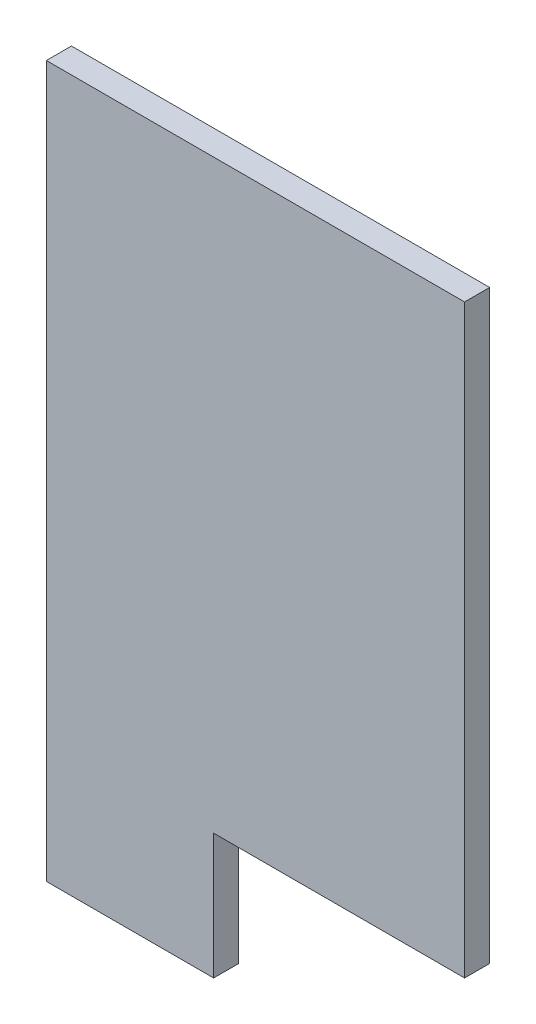
ISO-10303-21;
HEADER;
FILE_DESCRIPTION(('STEP AP214'),'2;1');
FILE_NAME('part.step','',(''),(''),'','','');
FILE_SCHEMA(('AUTOMOTIVE_DESIGN { 1 0 10303 214 1 1 1 1 }'));
ENDSEC;
DATA;
#1=APPLICATION_CONTEXT('core data for automotive mechanical design processes');
#2=APPLICATION_PROTOCOL_DEFINITION('international standard','automotive_design',2000,#1);
#3=PRODUCT_CONTEXT('',#1,'mechanical');
#4=PRODUCT('Part','Part','',(#3));
#5=PRODUCT_RELATED_PRODUCT_CATEGORY('part','',(#4));
#6=PRODUCT_DEFINITION_FORMATION('','',#4);
#7=PRODUCT_DEFINITION_CONTEXT('part definition',#1,'design');
#8=PRODUCT_DEFINITION('design','',#6,#7);
#9=PRODUCT_DEFINITION_SHAPE('','',#8);
#10=(LENGTH_UNIT() NAMED_UNIT(*) SI_UNIT(.MILLI.,.METRE.));
#11=(NAMED_UNIT(*) PLANE_ANGLE_UNIT() SI_UNIT($,.RADIAN.));
#12=(NAMED_UNIT(*) SI_UNIT($,.STERADIAN.) SOLID_ANGLE_UNIT());
#13=UNCERTAINTY_MEASURE_WITH_UNIT(LENGTH_MEASURE(1.E-05),#10,'distance_accuracy_value','');
#14=(GEOMETRIC_REPRESENTATION_CONTEXT(3) GLOBAL_UNCERTAINTY_ASSIGNED_CONTEXT((#13)) GLOBAL_UNIT_ASSIGNED_CONTEXT((#10,
#11,#12)) REPRESENTATION_CONTEXT('',''));
#15=CARTESIAN_POINT('',(0.,0.,0.));
#16=DIRECTION('',(0.,0.,1.));
#17=DIRECTION('',(1.,0.,0.));
#18=AXIS2_PLACEMENT_3D('',#15,#16,#17);
#19=CARTESIAN_POINT('',(25.,35.,3.));
#20=DIRECTION('',(-1.,0.,0.));
#21=DIRECTION('',(0.,0.,1.));
#22=AXIS2_PLACEMENT_3D('',#19,#20,#21);
#23=PLANE('',#22);
#24=DIRECTION('',(0.,1.,0.));
#25=VECTOR('',#24,1.);
#26=CARTESIAN_POINT('',(25.,35.,0.));
#27=LINE('',#26,#25);
#28=CARTESIAN_POINT('',(25.,-35.,0.));
#29=VERTEX_POINT('',#28);
#30=CARTESIAN_POINT('',(25.,35.,0.));
#31=VERTEX_POINT('',#30);
#32=EDGE_CURVE('E128',#29,#31,#27,.T.);
#33=ORIENTED_EDGE('',*,*,#32,.T.);
#34=DIRECTION('',(0.,0.,-1.));
#35=VECTOR('',#34,1.);
#36=CARTESIAN_POINT('',(25.,35.,3.));
#37=LINE('',#36,#35);
#38=CARTESIAN_POINT('',(25.,35.,3.));
#39=VERTEX_POINT('',#38);
#40=EDGE_CURVE('E11',#39,#31,#37,.T.);
#41=ORIENTED_EDGE('',*,*,#40,.F.);
#42=DIRECTION('',(0.,1.,0.));
#43=VECTOR('',#42,1.);
#44=CARTESIAN_POINT('',(25.,35.,3.));
#45=LINE('',#44,#43);
#46=CARTESIAN_POINT('',(25.,-35.,3.));
#47=VERTEX_POINT('',#46);
#48=EDGE_CURVE('E145',#47,#39,#45,.T.);
#49=ORIENTED_EDGE('',*,*,#48,.F.);
#50=DIRECTION('',(0.,0.,-1.));
#51=VECTOR('',#50,1.);
#52=CARTESIAN_POINT('',(25.,-35.,3.));
#53=LINE('',#52,#51);
#54=EDGE_CURVE('E124',#47,#29,#53,.T.);
#55=ORIENTED_EDGE('',*,*,#54,.T.);
#56=EDGE_LOOP('',(#33,#41,#49,#55));
#57=FACE_BOUND('',#56,.T.);
#58=ADVANCED_FACE('F39',(#57),#23,.F.);
#59=CARTESIAN_POINT('',(-25.,35.,3.));
#60=DIRECTION('',(0.,-1.,0.));
#61=DIRECTION('',(0.,0.,-1.));
#62=AXIS2_PLACEMENT_3D('',#59,#60,#61);
#63=PLANE('',#62);
#64=DIRECTION('',(-1.,0.,0.));
#65=VECTOR('',#64,1.);
#66=CARTESIAN_POINT('',(-25.,35.,0.));
#67=LINE('',#66,#65);
#68=CARTESIAN_POINT('',(-25.,35.,0.));
#69=VERTEX_POINT('',#68);
#70=EDGE_CURVE('E132',#31,#69,#67,.T.);
#71=ORIENTED_EDGE('',*,*,#70,.T.);
#72=DIRECTION('',(0.,0.,-1.));
#73=VECTOR('',#72,1.);
#74=CARTESIAN_POINT('',(-25.,35.,3.));
#75=LINE('',#74,#73);
#76=CARTESIAN_POINT('',(-25.,35.,3.));
#77=VERTEX_POINT('',#76);
#78=EDGE_CURVE('E48',#77,#69,#75,.T.);
#79=ORIENTED_EDGE('',*,*,#78,.F.);
#80=DIRECTION('',(-1.,0.,0.));
#81=VECTOR('',#80,1.);
#82=CARTESIAN_POINT('',(-25.,35.,3.));
#83=LINE('',#82,#81);
#84=EDGE_CURVE('E93',#39,#77,#83,.T.);
#85=ORIENTED_EDGE('',*,*,#84,.F.);
#86=ORIENTED_EDGE('',*,*,#40,.T.);
#87=EDGE_LOOP('',(#71,#79,#85,#86));
#88=FACE_BOUND('',#87,.T.);
#89=ADVANCED_FACE('F155',(#88),#63,.F.);
#90=CARTESIAN_POINT('',(-25.,-35.,3.));
#91=DIRECTION('',(1.,0.,0.));
#92=DIRECTION('',(0.,0.,-1.));
#93=AXIS2_PLACEMENT_3D('',#90,#91,#92);
#94=PLANE('',#93);
#95=DIRECTION('',(0.,-1.,0.));
#96=VECTOR('',#95,1.);
#97=CARTESIAN_POINT('',(-25.,-35.,0.));
#98=LINE('',#97,#96);
#99=CARTESIAN_POINT('',(-25.,-50.,0.));
#100=VERTEX_POINT('',#99);
#101=EDGE_CURVE('E136',#69,#100,#98,.T.);
#102=ORIENTED_EDGE('',*,*,#101,.T.);
#103=DIRECTION('',(0.,0.,-1.));
#104=VECTOR('',#103,1.);
#105=CARTESIAN_POINT('',(-25.,-50.,3.));
#106=LINE('',#105,#104);
#107=CARTESIAN_POINT('',(-25.,-50.,3.));
#108=VERTEX_POINT('',#107);
#109=EDGE_CURVE('E117',#108,#100,#106,.T.);
#110=ORIENTED_EDGE('',*,*,#109,.F.);
#111=DIRECTION('',(0.,-1.,0.));
#112=VECTOR('',#111,1.);
#113=CARTESIAN_POINT('',(-25.,35.,3.));
#114=LINE('',#113,#112);
#115=EDGE_CURVE('E106',#77,#108,#114,.T.);
#116=ORIENTED_EDGE('',*,*,#115,.F.);
#117=ORIENTED_EDGE('',*,*,#78,.T.);
#118=EDGE_LOOP('',(#102,#110,#116,#117));
#119=FACE_BOUND('',#118,.T.);
#120=ADVANCED_FACE('F154',(#119),#94,.F.);
#121=CARTESIAN_POINT('',(-25.,-50.,3.));
#122=DIRECTION('',(0.,1.,0.));
#123=DIRECTION('',(0.,0.,1.));
#124=AXIS2_PLACEMENT_3D('',#121,#122,#123);
#125=PLANE('',#124);
#126=DIRECTION('',(1.,0.,0.));
#127=VECTOR('',#126,1.);
#128=CARTESIAN_POINT('',(-25.,-50.,0.));
#129=LINE('',#128,#127);
#130=CARTESIAN_POINT('',(-4.99999999999999,-50.,0.));
#131=VERTEX_POINT('',#130);
#132=EDGE_CURVE('E115',#100,#131,#129,.T.);
#133=ORIENTED_EDGE('',*,*,#132,.T.);
#134=DIRECTION('',(0.,0.,-1.));
#135=VECTOR('',#134,1.);
#136=CARTESIAN_POINT('',(-4.99999999999999,-50.,3.));
#137=LINE('',#136,#135);
#138=CARTESIAN_POINT('',(-4.99999999999999,-50.,3.));
#139=VERTEX_POINT('',#138);
#140=EDGE_CURVE('E112',#139,#131,#137,.T.);
#141=ORIENTED_EDGE('',*,*,#140,.F.);
#142=DIRECTION('',(1.,0.,0.));
#143=VECTOR('',#142,1.);
#144=CARTESIAN_POINT('',(-25.,-50.,3.));
#145=LINE('',#144,#143);
#146=EDGE_CURVE('E100',#108,#139,#145,.T.);
#147=ORIENTED_EDGE('',*,*,#146,.F.);
#148=ORIENTED_EDGE('',*,*,#109,.T.);
#149=EDGE_LOOP('',(#133,#141,#147,#148));
#150=FACE_BOUND('',#149,.T.);
#151=ADVANCED_FACE('F113',(#150),#125,.F.);
#152=CARTESIAN_POINT('',(-4.99999999999999,-35.,3.));
#153=DIRECTION('',(-1.,0.,0.));
#154=DIRECTION('',(0.,0.,1.));
#155=AXIS2_PLACEMENT_3D('',#152,#153,#154);
#156=PLANE('',#155);
#157=DIRECTION('',(0.,1.,0.));
#158=VECTOR('',#157,1.);
#159=CARTESIAN_POINT('',(-4.99999999999999,-35.,0.));
#160=LINE('',#159,#158);
#161=CARTESIAN_POINT('',(-4.99999999999999,-35.,0.));
#162=VERTEX_POINT('',#161);
#163=EDGE_CURVE('E79',#131,#162,#160,.T.);
#164=ORIENTED_EDGE('',*,*,#163,.T.);
#165=DIRECTION('',(0.,0.,-1.));
#166=VECTOR('',#165,1.);
#167=CARTESIAN_POINT('',(-4.99999999999999,-35.,3.));
#168=LINE('',#167,#166);
#169=CARTESIAN_POINT('',(-4.99999999999999,-35.,3.));
#170=VERTEX_POINT('',#169);
#171=EDGE_CURVE('E118',#170,#162,#168,.T.);
#172=ORIENTED_EDGE('',*,*,#171,.F.);
#173=DIRECTION('',(0.,1.,0.));
#174=VECTOR('',#173,1.);
#175=CARTESIAN_POINT('',(-4.99999999999999,-35.,3.));
#176=LINE('',#175,#174);
#177=EDGE_CURVE('E104',#139,#170,#176,.T.);
#178=ORIENTED_EDGE('',*,*,#177,.F.);
#179=ORIENTED_EDGE('',*,*,#140,.T.);
#180=EDGE_LOOP('',(#164,#172,#178,#179));
#181=FACE_BOUND('',#180,.T.);
#182=ADVANCED_FACE('F120',(#181),#156,.F.);
#183=CARTESIAN_POINT('',(-4.99999999999999,-35.,3.));
#184=DIRECTION('',(0.,1.,0.));
#185=DIRECTION('',(0.,0.,1.));
#186=AXIS2_PLACEMENT_3D('',#183,#184,#185);
#187=PLANE('',#186);
#188=DIRECTION('',(1.,0.,0.));
#189=VECTOR('',#188,1.);
#190=CARTESIAN_POINT('',(-4.99999999999999,-35.,0.));
#191=LINE('',#190,#189);
#192=EDGE_CURVE('E85',#162,#29,#191,.T.);
#193=ORIENTED_EDGE('',*,*,#192,.T.);
#194=ORIENTED_EDGE('',*,*,#54,.F.);
#195=DIRECTION('',(1.,0.,0.));
#196=VECTOR('',#195,1.);
#197=CARTESIAN_POINT('',(-4.99999999999999,-35.,3.));
#198=LINE('',#197,#196);
#199=EDGE_CURVE('E56',#170,#47,#198,.T.);
#200=ORIENTED_EDGE('',*,*,#199,.F.);
#201=ORIENTED_EDGE('',*,*,#171,.T.);
#202=EDGE_LOOP('',(#193,#194,#200,#201));
#203=FACE_BOUND('',#202,.T.);
#204=ADVANCED_FACE('F162',(#203),#187,.F.);
#205=CARTESIAN_POINT('',(0.,0.,3.));
#206=DIRECTION('',(0.,0.,1.));
#207=DIRECTION('',(1.,0.,0.));
#208=AXIS2_PLACEMENT_3D('',#205,#206,#207);
#209=PLANE('',#208);
#210=ORIENTED_EDGE('',*,*,#48,.T.);
#211=ORIENTED_EDGE('',*,*,#84,.T.);
#212=ORIENTED_EDGE('',*,*,#115,.T.);
#213=ORIENTED_EDGE('',*,*,#146,.T.);
#214=ORIENTED_EDGE('',*,*,#177,.T.);
#215=ORIENTED_EDGE('',*,*,#199,.T.);
#216=EDGE_LOOP('',(#210,#211,#212,#213,#214,#215));
#217=FACE_BOUND('',#216,.T.);
#218=ADVANCED_FACE('F102',(#217),#209,.T.);
#219=CARTESIAN_POINT('',(0.,0.,0.));
#220=DIRECTION('',(0.,0.,1.));
#221=DIRECTION('',(1.,0.,0.));
#222=AXIS2_PLACEMENT_3D('',#219,#220,#221);
#223=PLANE('',#222);
#224=ORIENTED_EDGE('',*,*,#32,.F.);
#225=ORIENTED_EDGE('',*,*,#192,.F.);
#226=ORIENTED_EDGE('',*,*,#163,.F.);
#227=ORIENTED_EDGE('',*,*,#132,.F.);
#228=ORIENTED_EDGE('',*,*,#101,.F.);
#229=ORIENTED_EDGE('',*,*,#70,.F.);
#230=EDGE_LOOP('',(#224,#225,#226,#227,#228,#229));
#231=FACE_BOUND('',#230,.T.);
#232=ADVANCED_FACE('F159',(#231),#223,.F.);
#233=CLOSED_SHELL('',(#58,#89,#120,#151,#182,#204,#218,#232));
#234=MANIFOLD_SOLID_BREP('B2',#233);
#235=ADVANCED_BREP_SHAPE_REPRESENTATION('',(#18,#234),#14);
#236=SHAPE_DEFINITION_REPRESENTATION(#9,#235);
ENDSEC;
END-ISO-10303-21;
